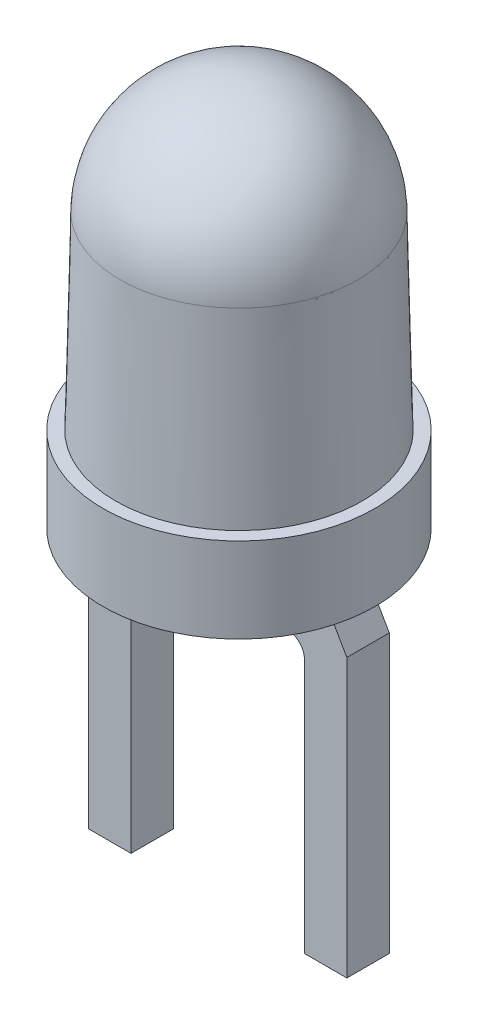
ISO-10303-21;
HEADER;
FILE_DESCRIPTION(('STEP AP214'),'2;1');
FILE_NAME('part.step','',(''),(''),'','','');
FILE_SCHEMA(('AUTOMOTIVE_DESIGN { 1 0 10303 214 1 1 1 1 }'));
ENDSEC;
DATA;
#1=APPLICATION_CONTEXT('core data for automotive mechanical design processes');
#2=APPLICATION_PROTOCOL_DEFINITION('international standard','automotive_design',2000,#1);
#3=PRODUCT_CONTEXT('',#1,'mechanical');
#4=PRODUCT('Part','Part','',(#3));
#5=PRODUCT_RELATED_PRODUCT_CATEGORY('part','',(#4));
#6=PRODUCT_DEFINITION_FORMATION('','',#4);
#7=PRODUCT_DEFINITION_CONTEXT('part definition',#1,'design');
#8=PRODUCT_DEFINITION('design','',#6,#7);
#9=PRODUCT_DEFINITION_SHAPE('','',#8);
#10=(LENGTH_UNIT() NAMED_UNIT(*) SI_UNIT(.MILLI.,.METRE.));
#11=(NAMED_UNIT(*) PLANE_ANGLE_UNIT() SI_UNIT($,.RADIAN.));
#12=(NAMED_UNIT(*) SI_UNIT($,.STERADIAN.) SOLID_ANGLE_UNIT());
#13=UNCERTAINTY_MEASURE_WITH_UNIT(LENGTH_MEASURE(1.E-05),#10,'distance_accuracy_value','');
#14=(GEOMETRIC_REPRESENTATION_CONTEXT(3) GLOBAL_UNCERTAINTY_ASSIGNED_CONTEXT((#13)) GLOBAL_UNIT_ASSIGNED_CONTEXT((#10,
#11,#12)) REPRESENTATION_CONTEXT('',''));
#15=CARTESIAN_POINT('',(0.,0.,0.));
#16=DIRECTION('',(0.,0.,1.));
#17=DIRECTION('',(1.,0.,0.));
#18=AXIS2_PLACEMENT_3D('',#15,#16,#17);
#19=CARTESIAN_POINT('',(0.,-36.0493117558647,0.25));
#20=DIRECTION('',(0.,0.,1.));
#21=DIRECTION('',(1.,0.,0.));
#22=AXIS2_PLACEMENT_3D('',#19,#20,#21);
#23=PLANE('',#22);
#24=DIRECTION('',(-0.500000000000017,-0.866025403784429,0.));
#25=VECTOR('',#24,1.);
#26=CARTESIAN_POINT('',(-1.27,0.,0.25));
#27=LINE('',#26,#25);
#28=CARTESIAN_POINT('',(-1.27,0.,0.25));
#29=VERTEX_POINT('',#28);
#30=CARTESIAN_POINT('',(-1.52,-0.433012701892208,0.25));
#31=VERTEX_POINT('',#30);
#32=EDGE_CURVE('E233',#29,#31,#27,.T.);
#33=ORIENTED_EDGE('',*,*,#32,.T.);
#34=DIRECTION('',(0.,1.,0.));
#35=VECTOR('',#34,1.);
#36=CARTESIAN_POINT('',(-1.52,-36.0493117558647,0.25));
#37=LINE('',#36,#35);
#38=CARTESIAN_POINT('',(-1.52,-3.7,0.25));
#39=VERTEX_POINT('',#38);
#40=EDGE_CURVE('E169',#31,#39,#37,.F.);
#41=ORIENTED_EDGE('',*,*,#40,.T.);
#42=DIRECTION('',(1.,0.,0.));
#43=VECTOR('',#42,1.);
#44=CARTESIAN_POINT('',(0.,-3.7,0.25));
#45=LINE('',#44,#43);
#46=CARTESIAN_POINT('',(-1.02,-3.7,0.25));
#47=VERTEX_POINT('',#46);
#48=EDGE_CURVE('E141',#39,#47,#45,.T.);
#49=ORIENTED_EDGE('',*,*,#48,.T.);
#50=DIRECTION('',(0.,-1.,0.));
#51=VECTOR('',#50,1.);
#52=CARTESIAN_POINT('',(-1.02,-36.0493117558647,0.25));
#53=LINE('',#52,#51);
#54=CARTESIAN_POINT('',(-1.02,-0.7,0.25));
#55=VERTEX_POINT('',#54);
#56=EDGE_CURVE('E138',#47,#55,#53,.F.);
#57=ORIENTED_EDGE('',*,*,#56,.T.);
#58=CARTESIAN_POINT('',(-0.820000000000004,-0.7,0.25));
#59=DIRECTION('',(0.,0.,1.));
#60=DIRECTION('',(1.,0.,0.));
#61=AXIS2_PLACEMENT_3D('',#58,#59,#60);
#62=CIRCLE('',#61,0.2);
#63=CARTESIAN_POINT('',(-0.820000000000004,-0.5,0.25));
#64=VERTEX_POINT('',#63);
#65=EDGE_CURVE('E19',#55,#64,#62,.F.);
#66=ORIENTED_EDGE('',*,*,#65,.T.);
#67=DIRECTION('',(1.,0.,0.));
#68=VECTOR('',#67,1.);
#69=CARTESIAN_POINT('',(0.,-0.5,0.25));
#70=LINE('',#69,#68);
#71=CARTESIAN_POINT('',(-0.420000000000004,-0.5,0.25));
#72=VERTEX_POINT('',#71);
#73=EDGE_CURVE('E178',#64,#72,#70,.T.);
#74=ORIENTED_EDGE('',*,*,#73,.T.);
#75=DIRECTION('',(0.,1.,0.));
#76=VECTOR('',#75,1.);
#77=CARTESIAN_POINT('',(-0.420000000000004,-36.0493117558647,0.25));
#78=LINE('',#77,#76);
#79=CARTESIAN_POINT('',(-0.420000000000003,0.,0.25));
#80=VERTEX_POINT('',#79);
#81=EDGE_CURVE('E239',#72,#80,#78,.T.);
#82=ORIENTED_EDGE('',*,*,#81,.T.);
#83=DIRECTION('',(1.,0.,0.));
#84=VECTOR('',#83,1.);
#85=CARTESIAN_POINT('',(0.,0.,0.25));
#86=LINE('',#85,#84);
#87=EDGE_CURVE('E236',#80,#29,#86,.F.);
#88=ORIENTED_EDGE('',*,*,#87,.T.);
#89=EDGE_LOOP('',(#33,#41,#49,#57,#66,#74,#82,#88));
#90=FACE_BOUND('',#89,.T.);
#91=ADVANCED_FACE('F16',(#90),#23,.T.);
#92=CARTESIAN_POINT('',(0.,-36.0493117558647,0.25));
#93=DIRECTION('',(0.,0.,1.));
#94=DIRECTION('',(1.,0.,0.));
#95=AXIS2_PLACEMENT_3D('',#92,#93,#94);
#96=PLANE('',#95);
#97=CARTESIAN_POINT('',(0.820000000000004,-0.699999999999999,0.25));
#98=DIRECTION('',(0.,0.,1.));
#99=DIRECTION('',(1.,0.,0.));
#100=AXIS2_PLACEMENT_3D('',#97,#98,#99);
#101=CIRCLE('',#100,0.2);
#102=CARTESIAN_POINT('',(0.820000000000004,-0.5,0.25));
#103=VERTEX_POINT('',#102);
#104=CARTESIAN_POINT('',(1.02,-0.699999999999999,0.25));
#105=VERTEX_POINT('',#104);
#106=EDGE_CURVE('E145',#103,#105,#101,.F.);
#107=ORIENTED_EDGE('',*,*,#106,.T.);
#108=DIRECTION('',(0.,-1.,0.));
#109=VECTOR('',#108,1.);
#110=CARTESIAN_POINT('',(1.02,-36.0493117558647,0.25));
#111=LINE('',#110,#109);
#112=CARTESIAN_POINT('',(1.02,-3.7,0.25));
#113=VERTEX_POINT('',#112);
#114=EDGE_CURVE('E205',#113,#105,#111,.F.);
#115=ORIENTED_EDGE('',*,*,#114,.F.);
#116=DIRECTION('',(1.,0.,0.));
#117=VECTOR('',#116,1.);
#118=CARTESIAN_POINT('',(0.,-3.7,0.25));
#119=LINE('',#118,#117);
#120=CARTESIAN_POINT('',(1.52,-3.7,0.25));
#121=VERTEX_POINT('',#120);
#122=EDGE_CURVE('E211',#113,#121,#119,.T.);
#123=ORIENTED_EDGE('',*,*,#122,.T.);
#124=DIRECTION('',(0.,1.,0.));
#125=VECTOR('',#124,1.);
#126=CARTESIAN_POINT('',(1.52,-36.0493117558647,0.25));
#127=LINE('',#126,#125);
#128=CARTESIAN_POINT('',(1.52,-0.433012701892209,0.25));
#129=VERTEX_POINT('',#128);
#130=EDGE_CURVE('E219',#129,#121,#127,.F.);
#131=ORIENTED_EDGE('',*,*,#130,.F.);
#132=DIRECTION('',(-0.500000000000005,0.866025403784436,0.));
#133=VECTOR('',#132,1.);
#134=CARTESIAN_POINT('',(1.52,-0.433012701892214,0.25));
#135=LINE('',#134,#133);
#136=CARTESIAN_POINT('',(1.27,0.,0.25));
#137=VERTEX_POINT('',#136);
#138=EDGE_CURVE('E235',#129,#137,#135,.T.);
#139=ORIENTED_EDGE('',*,*,#138,.T.);
#140=DIRECTION('',(1.,0.,0.));
#141=VECTOR('',#140,1.);
#142=CARTESIAN_POINT('',(0.,0.,0.25));
#143=LINE('',#142,#141);
#144=CARTESIAN_POINT('',(0.420000000000001,0.,0.25));
#145=VERTEX_POINT('',#144);
#146=EDGE_CURVE('E246',#137,#145,#143,.F.);
#147=ORIENTED_EDGE('',*,*,#146,.T.);
#148=DIRECTION('',(0.,1.,0.));
#149=VECTOR('',#148,1.);
#150=CARTESIAN_POINT('',(0.420000000000001,-36.0493117558647,0.25));
#151=LINE('',#150,#149);
#152=CARTESIAN_POINT('',(0.420000000000002,-0.5,0.25));
#153=VERTEX_POINT('',#152);
#154=EDGE_CURVE('E202',#145,#153,#151,.F.);
#155=ORIENTED_EDGE('',*,*,#154,.T.);
#156=DIRECTION('',(1.,0.,0.));
#157=VECTOR('',#156,1.);
#158=CARTESIAN_POINT('',(0.,-0.5,0.25));
#159=LINE('',#158,#157);
#160=EDGE_CURVE('E136',#153,#103,#159,.T.);
#161=ORIENTED_EDGE('',*,*,#160,.T.);
#162=EDGE_LOOP('',(#107,#115,#123,#131,#139,#147,#155,#161));
#163=FACE_BOUND('',#162,.T.);
#164=ADVANCED_FACE('F303',(#163),#96,.T.);
#165=CARTESIAN_POINT('',(-0.820000000000004,-0.7,0.25));
#166=DIRECTION('',(0.,0.,1.));
#167=DIRECTION('',(1.,0.,0.));
#168=AXIS2_PLACEMENT_3D('',#165,#166,#167);
#169=CYLINDRICAL_SURFACE('',#168,0.2);
#170=DIRECTION('',(0.,0.,1.));
#171=VECTOR('',#170,1.);
#172=CARTESIAN_POINT('',(-1.02,-0.699999999999999,0.25));
#173=LINE('',#172,#171);
#174=CARTESIAN_POINT('',(-1.02,-0.7,-0.25));
#175=VERTEX_POINT('',#174);
#176=EDGE_CURVE('E129',#55,#175,#173,.F.);
#177=ORIENTED_EDGE('',*,*,#176,.T.);
#178=CARTESIAN_POINT('',(-0.820000000000004,-0.7,-0.25));
#179=DIRECTION('',(0.,0.,1.));
#180=DIRECTION('',(1.,0.,0.));
#181=AXIS2_PLACEMENT_3D('',#178,#179,#180);
#182=CIRCLE('',#181,0.2);
#183=CARTESIAN_POINT('',(-0.820000000000004,-0.5,-0.25));
#184=VERTEX_POINT('',#183);
#185=EDGE_CURVE('E190',#175,#184,#182,.F.);
#186=ORIENTED_EDGE('',*,*,#185,.T.);
#187=DIRECTION('',(0.,0.,1.));
#188=VECTOR('',#187,1.);
#189=CARTESIAN_POINT('',(-0.820000000000004,-0.5,0.25));
#190=LINE('',#189,#188);
#191=EDGE_CURVE('E132',#184,#64,#190,.T.);
#192=ORIENTED_EDGE('',*,*,#191,.T.);
#193=ORIENTED_EDGE('',*,*,#65,.F.);
#194=EDGE_LOOP('',(#177,#186,#192,#193));
#195=FACE_BOUND('',#194,.T.);
#196=ADVANCED_FACE('F127',(#195),#169,.F.);
#197=CARTESIAN_POINT('',(0.,-0.5,0.25));
#198=DIRECTION('',(0.,1.,0.));
#199=DIRECTION('',(0.,0.,1.));
#200=AXIS2_PLACEMENT_3D('',#197,#198,#199);
#201=PLANE('',#200);
#202=ORIENTED_EDGE('',*,*,#191,.F.);
#203=DIRECTION('',(1.,0.,0.));
#204=VECTOR('',#203,1.);
#205=CARTESIAN_POINT('',(0.,-0.5,-0.25));
#206=LINE('',#205,#204);
#207=CARTESIAN_POINT('',(-0.420000000000004,-0.5,-0.25));
#208=VERTEX_POINT('',#207);
#209=EDGE_CURVE('E195',#184,#208,#206,.T.);
#210=ORIENTED_EDGE('',*,*,#209,.T.);
#211=DIRECTION('',(0.,0.,1.));
#212=VECTOR('',#211,1.);
#213=CARTESIAN_POINT('',(-0.420000000000004,-0.5,0.25));
#214=LINE('',#213,#212);
#215=EDGE_CURVE('E187',#208,#72,#214,.T.);
#216=ORIENTED_EDGE('',*,*,#215,.T.);
#217=ORIENTED_EDGE('',*,*,#73,.F.);
#218=EDGE_LOOP('',(#202,#210,#216,#217));
#219=FACE_BOUND('',#218,.T.);
#220=ADVANCED_FACE('F428',(#219),#201,.F.);
#221=CARTESIAN_POINT('',(-1.52,-36.0493117558647,0.25));
#222=DIRECTION('',(1.,0.,0.));
#223=DIRECTION('',(0.,1.,0.));
#224=AXIS2_PLACEMENT_3D('',#221,#222,#223);
#225=PLANE('',#224);
#226=DIRECTION('',(0.,0.,1.));
#227=VECTOR('',#226,1.);
#228=CARTESIAN_POINT('',(-1.52,-3.7,0.25));
#229=LINE('',#228,#227);
#230=CARTESIAN_POINT('',(-1.52,-3.7,-0.25));
#231=VERTEX_POINT('',#230);
#232=EDGE_CURVE('E154',#231,#39,#229,.T.);
#233=ORIENTED_EDGE('',*,*,#232,.T.);
#234=ORIENTED_EDGE('',*,*,#40,.F.);
#235=DIRECTION('',(0.,0.,1.));
#236=VECTOR('',#235,1.);
#237=CARTESIAN_POINT('',(-1.52,-0.433012701892208,0.25));
#238=LINE('',#237,#236);
#239=CARTESIAN_POINT('',(-1.52,-0.433012701892209,-0.25));
#240=VERTEX_POINT('',#239);
#241=EDGE_CURVE('E176',#240,#31,#238,.T.);
#242=ORIENTED_EDGE('',*,*,#241,.F.);
#243=DIRECTION('',(0.,1.,0.));
#244=VECTOR('',#243,1.);
#245=CARTESIAN_POINT('',(-1.52,-36.0493117558647,-0.25));
#246=LINE('',#245,#244);
#247=EDGE_CURVE('E164',#240,#231,#246,.F.);
#248=ORIENTED_EDGE('',*,*,#247,.T.);
#249=EDGE_LOOP('',(#233,#234,#242,#248));
#250=FACE_BOUND('',#249,.T.);
#251=ADVANCED_FACE('F424',(#250),#225,.F.);
#252=CARTESIAN_POINT('',(0.,-3.7,0.25));
#253=DIRECTION('',(0.,1.,0.));
#254=DIRECTION('',(0.,0.,1.));
#255=AXIS2_PLACEMENT_3D('',#252,#253,#254);
#256=PLANE('',#255);
#257=ORIENTED_EDGE('',*,*,#232,.F.);
#258=DIRECTION('',(1.,0.,0.));
#259=VECTOR('',#258,1.);
#260=CARTESIAN_POINT('',(0.,-3.7,-0.25));
#261=LINE('',#260,#259);
#262=CARTESIAN_POINT('',(-1.02,-3.7,-0.25));
#263=VERTEX_POINT('',#262);
#264=EDGE_CURVE('E162',#231,#263,#261,.T.);
#265=ORIENTED_EDGE('',*,*,#264,.T.);
#266=DIRECTION('',(0.,0.,1.));
#267=VECTOR('',#266,1.);
#268=CARTESIAN_POINT('',(-1.02,-3.7,0.25));
#269=LINE('',#268,#267);
#270=EDGE_CURVE('E146',#263,#47,#269,.T.);
#271=ORIENTED_EDGE('',*,*,#270,.T.);
#272=ORIENTED_EDGE('',*,*,#48,.F.);
#273=EDGE_LOOP('',(#257,#265,#271,#272));
#274=FACE_BOUND('',#273,.T.);
#275=ADVANCED_FACE('F421',(#274),#256,.F.);
#276=CARTESIAN_POINT('',(-1.02,-36.0493117558647,0.25));
#277=DIRECTION('',(-1.,0.,0.));
#278=DIRECTION('',(0.,-1.,0.));
#279=AXIS2_PLACEMENT_3D('',#276,#277,#278);
#280=PLANE('',#279);
#281=ORIENTED_EDGE('',*,*,#270,.F.);
#282=DIRECTION('',(0.,1.,0.));
#283=VECTOR('',#282,1.);
#284=CARTESIAN_POINT('',(-1.02,-36.0493117558647,-0.25));
#285=LINE('',#284,#283);
#286=EDGE_CURVE('E150',#263,#175,#285,.T.);
#287=ORIENTED_EDGE('',*,*,#286,.T.);
#288=ORIENTED_EDGE('',*,*,#176,.F.);
#289=ORIENTED_EDGE('',*,*,#56,.F.);
#290=EDGE_LOOP('',(#281,#287,#288,#289));
#291=FACE_BOUND('',#290,.T.);
#292=ADVANCED_FACE('F148',(#291),#280,.F.);
#293=CARTESIAN_POINT('',(0.820000000000004,-0.699999999999999,0.25));
#294=DIRECTION('',(0.,0.,1.));
#295=DIRECTION('',(1.,0.,0.));
#296=AXIS2_PLACEMENT_3D('',#293,#294,#295);
#297=CYLINDRICAL_SURFACE('',#296,0.2);
#298=DIRECTION('',(0.,0.,1.));
#299=VECTOR('',#298,1.);
#300=CARTESIAN_POINT('',(0.820000000000004,-0.5,0.25));
#301=LINE('',#300,#299);
#302=CARTESIAN_POINT('',(0.820000000000004,-0.5,-0.25));
#303=VERTEX_POINT('',#302);
#304=EDGE_CURVE('E191',#303,#103,#301,.T.);
#305=ORIENTED_EDGE('',*,*,#304,.F.);
#306=CARTESIAN_POINT('',(0.820000000000004,-0.699999999999999,-0.25));
#307=DIRECTION('',(0.,0.,1.));
#308=DIRECTION('',(1.,0.,0.));
#309=AXIS2_PLACEMENT_3D('',#306,#307,#308);
#310=CIRCLE('',#309,0.2);
#311=CARTESIAN_POINT('',(1.02,-0.699999999999999,-0.25));
#312=VERTEX_POINT('',#311);
#313=EDGE_CURVE('E296',#303,#312,#310,.F.);
#314=ORIENTED_EDGE('',*,*,#313,.T.);
#315=DIRECTION('',(0.,0.,1.));
#316=VECTOR('',#315,1.);
#317=CARTESIAN_POINT('',(1.02,-0.699999999999999,0.25));
#318=LINE('',#317,#316);
#319=EDGE_CURVE('E208',#105,#312,#318,.F.);
#320=ORIENTED_EDGE('',*,*,#319,.F.);
#321=ORIENTED_EDGE('',*,*,#106,.F.);
#322=EDGE_LOOP('',(#305,#314,#320,#321));
#323=FACE_BOUND('',#322,.T.);
#324=ADVANCED_FACE('F308',(#323),#297,.F.);
#325=CARTESIAN_POINT('',(1.02,-36.0493117558647,0.25));
#326=DIRECTION('',(-1.,0.,0.));
#327=DIRECTION('',(0.,-1.,0.));
#328=AXIS2_PLACEMENT_3D('',#325,#326,#327);
#329=PLANE('',#328);
#330=ORIENTED_EDGE('',*,*,#319,.T.);
#331=DIRECTION('',(0.,1.,0.));
#332=VECTOR('',#331,1.);
#333=CARTESIAN_POINT('',(1.02,-36.0493117558647,-0.25));
#334=LINE('',#333,#332);
#335=CARTESIAN_POINT('',(1.02,-3.7,-0.25));
#336=VERTEX_POINT('',#335);
#337=EDGE_CURVE('E298',#312,#336,#334,.F.);
#338=ORIENTED_EDGE('',*,*,#337,.T.);
#339=DIRECTION('',(0.,0.,1.));
#340=VECTOR('',#339,1.);
#341=CARTESIAN_POINT('',(1.02,-3.7,0.25));
#342=LINE('',#341,#340);
#343=EDGE_CURVE('E213',#336,#113,#342,.T.);
#344=ORIENTED_EDGE('',*,*,#343,.T.);
#345=ORIENTED_EDGE('',*,*,#114,.T.);
#346=EDGE_LOOP('',(#330,#338,#344,#345));
#347=FACE_BOUND('',#346,.T.);
#348=ADVANCED_FACE('F313',(#347),#329,.T.);
#349=CARTESIAN_POINT('',(0.,-3.7,0.25));
#350=DIRECTION('',(0.,1.,0.));
#351=DIRECTION('',(0.,0.,1.));
#352=AXIS2_PLACEMENT_3D('',#349,#350,#351);
#353=PLANE('',#352);
#354=DIRECTION('',(1.,0.,0.));
#355=VECTOR('',#354,1.);
#356=CARTESIAN_POINT('',(0.,-3.7,-0.25));
#357=LINE('',#356,#355);
#358=CARTESIAN_POINT('',(1.52,-3.7,-0.25));
#359=VERTEX_POINT('',#358);
#360=EDGE_CURVE('E349',#336,#359,#357,.T.);
#361=ORIENTED_EDGE('',*,*,#360,.T.);
#362=DIRECTION('',(0.,0.,1.));
#363=VECTOR('',#362,1.);
#364=CARTESIAN_POINT('',(1.52,-3.7,0.25));
#365=LINE('',#364,#363);
#366=EDGE_CURVE('E216',#121,#359,#365,.F.);
#367=ORIENTED_EDGE('',*,*,#366,.F.);
#368=ORIENTED_EDGE('',*,*,#122,.F.);
#369=ORIENTED_EDGE('',*,*,#343,.F.);
#370=EDGE_LOOP('',(#361,#367,#368,#369));
#371=FACE_BOUND('',#370,.T.);
#372=ADVANCED_FACE('F320',(#371),#353,.F.);
#373=CARTESIAN_POINT('',(1.52,-36.0493117558647,0.25));
#374=DIRECTION('',(1.,0.,0.));
#375=DIRECTION('',(0.,1.,0.));
#376=AXIS2_PLACEMENT_3D('',#373,#374,#375);
#377=PLANE('',#376);
#378=DIRECTION('',(0.,0.,1.));
#379=VECTOR('',#378,1.);
#380=CARTESIAN_POINT('',(1.51999999999999,-0.433012701892211,0.25));
#381=LINE('',#380,#379);
#382=CARTESIAN_POINT('',(1.52,-0.433012701892212,-0.25));
#383=VERTEX_POINT('',#382);
#384=EDGE_CURVE('E183',#129,#383,#381,.F.);
#385=ORIENTED_EDGE('',*,*,#384,.F.);
#386=ORIENTED_EDGE('',*,*,#130,.T.);
#387=ORIENTED_EDGE('',*,*,#366,.T.);
#388=DIRECTION('',(0.,1.,0.));
#389=VECTOR('',#388,1.);
#390=CARTESIAN_POINT('',(1.52,-36.0493117558647,-0.25));
#391=LINE('',#390,#389);
#392=EDGE_CURVE('E327',#359,#383,#391,.T.);
#393=ORIENTED_EDGE('',*,*,#392,.T.);
#394=EDGE_LOOP('',(#385,#386,#387,#393));
#395=FACE_BOUND('',#394,.T.);
#396=ADVANCED_FACE('F325',(#395),#377,.T.);
#397=CARTESIAN_POINT('',(0.,-0.5,0.25));
#398=DIRECTION('',(0.,-1.,0.));
#399=DIRECTION('',(1.,0.,0.));
#400=AXIS2_PLACEMENT_3D('',#397,#398,#399);
#401=PLANE('',#400);
#402=ORIENTED_EDGE('',*,*,#160,.F.);
#403=DIRECTION('',(0.,0.,1.));
#404=VECTOR('',#403,1.);
#405=CARTESIAN_POINT('',(0.420000000000004,-0.5,0.25));
#406=LINE('',#405,#404);
#407=CARTESIAN_POINT('',(0.420000000000001,-0.5,-0.25));
#408=VERTEX_POINT('',#407);
#409=EDGE_CURVE('E286',#408,#153,#406,.T.);
#410=ORIENTED_EDGE('',*,*,#409,.F.);
#411=DIRECTION('',(1.,0.,0.));
#412=VECTOR('',#411,1.);
#413=CARTESIAN_POINT('',(0.,-0.5,-0.25));
#414=LINE('',#413,#412);
#415=EDGE_CURVE('E299',#408,#303,#414,.T.);
#416=ORIENTED_EDGE('',*,*,#415,.T.);
#417=ORIENTED_EDGE('',*,*,#304,.T.);
#418=EDGE_LOOP('',(#402,#410,#416,#417));
#419=FACE_BOUND('',#418,.T.);
#420=ADVANCED_FACE('F407',(#419),#401,.T.);
#421=CARTESIAN_POINT('',(-0.420000000000232,-36.0493117558647,0.25));
#422=DIRECTION('',(-1.,0.,0.));
#423=DIRECTION('',(0.,-1.,0.));
#424=AXIS2_PLACEMENT_3D('',#421,#422,#423);
#425=PLANE('',#424);
#426=DIRECTION('',(0.,0.,-1.));
#427=VECTOR('',#426,1.);
#428=CARTESIAN_POINT('',(-0.420000000000001,0.,0.));
#429=LINE('',#428,#427);
#430=CARTESIAN_POINT('',(-0.420000000000002,0.,-0.25));
#431=VERTEX_POINT('',#430);
#432=EDGE_CURVE('E283',#80,#431,#429,.T.);
#433=ORIENTED_EDGE('',*,*,#432,.F.);
#434=ORIENTED_EDGE('',*,*,#81,.F.);
#435=ORIENTED_EDGE('',*,*,#215,.F.);
#436=DIRECTION('',(0.,1.,0.));
#437=VECTOR('',#436,1.);
#438=CARTESIAN_POINT('',(-0.420000000000004,-36.0493117558647,-0.25));
#439=LINE('',#438,#437);
#440=EDGE_CURVE('E173',#208,#431,#439,.T.);
#441=ORIENTED_EDGE('',*,*,#440,.T.);
#442=EDGE_LOOP('',(#433,#434,#435,#441));
#443=FACE_BOUND('',#442,.T.);
#444=ADVANCED_FACE('F403',(#443),#425,.F.);
#445=CARTESIAN_POINT('',(0.,-36.0493117558647,-0.25));
#446=DIRECTION('',(0.,0.,1.));
#447=DIRECTION('',(1.,0.,0.));
#448=AXIS2_PLACEMENT_3D('',#445,#446,#447);
#449=PLANE('',#448);
#450=ORIENTED_EDGE('',*,*,#264,.F.);
#451=ORIENTED_EDGE('',*,*,#247,.F.);
#452=DIRECTION('',(0.500000000000012,0.866025403784432,0.));
#453=VECTOR('',#452,1.);
#454=CARTESIAN_POINT('',(-16.5623098847622,-26.487057685495,-0.25));
#455=LINE('',#454,#453);
#456=CARTESIAN_POINT('',(-1.27,0.,-0.25));
#457=VERTEX_POINT('',#456);
#458=EDGE_CURVE('E181',#240,#457,#455,.T.);
#459=ORIENTED_EDGE('',*,*,#458,.T.);
#460=DIRECTION('',(1.,0.,0.));
#461=VECTOR('',#460,1.);
#462=CARTESIAN_POINT('',(0.,0.,-0.25));
#463=LINE('',#462,#461);
#464=EDGE_CURVE('E276',#431,#457,#463,.F.);
#465=ORIENTED_EDGE('',*,*,#464,.F.);
#466=ORIENTED_EDGE('',*,*,#440,.F.);
#467=ORIENTED_EDGE('',*,*,#209,.F.);
#468=ORIENTED_EDGE('',*,*,#185,.F.);
#469=ORIENTED_EDGE('',*,*,#286,.F.);
#470=EDGE_LOOP('',(#450,#451,#459,#465,#466,#467,#468,#469));
#471=FACE_BOUND('',#470,.T.);
#472=ADVANCED_FACE('F399',(#471),#449,.F.);
#473=CARTESIAN_POINT('',(-16.5623098847622,-26.487057685495,0.25));
#474=DIRECTION('',(0.866025403784432,-0.500000000000012,0.));
#475=DIRECTION('',(0.500000000000012,0.866025403784432,0.));
#476=AXIS2_PLACEMENT_3D('',#473,#474,#475);
#477=PLANE('',#476);
#478=ORIENTED_EDGE('',*,*,#241,.T.);
#479=ORIENTED_EDGE('',*,*,#32,.F.);
#480=DIRECTION('',(0.,0.,-1.));
#481=VECTOR('',#480,1.);
#482=CARTESIAN_POINT('',(-1.27,0.,0.));
#483=LINE('',#482,#481);
#484=EDGE_CURVE('E263',#457,#29,#483,.F.);
#485=ORIENTED_EDGE('',*,*,#484,.F.);
#486=ORIENTED_EDGE('',*,*,#458,.F.);
#487=EDGE_LOOP('',(#478,#479,#485,#486));
#488=FACE_BOUND('',#487,.T.);
#489=ADVANCED_FACE('F396',(#488),#477,.F.);
#490=CARTESIAN_POINT('',(16.562309884762,-26.4870576854953,0.25));
#491=DIRECTION('',(0.866025403784437,0.500000000000003,0.));
#492=DIRECTION('',(-0.500000000000003,0.866025403784437,0.));
#493=AXIS2_PLACEMENT_3D('',#490,#491,#492);
#494=PLANE('',#493);
#495=ORIENTED_EDGE('',*,*,#138,.F.);
#496=ORIENTED_EDGE('',*,*,#384,.T.);
#497=DIRECTION('',(-0.500000000000005,0.866025403784436,0.));
#498=VECTOR('',#497,1.);
#499=CARTESIAN_POINT('',(1.52,-0.433012701892214,-0.25));
#500=LINE('',#499,#498);
#501=CARTESIAN_POINT('',(1.27,0.,-0.25));
#502=VERTEX_POINT('',#501);
#503=EDGE_CURVE('E271',#383,#502,#500,.T.);
#504=ORIENTED_EDGE('',*,*,#503,.T.);
#505=DIRECTION('',(0.,0.,-1.));
#506=VECTOR('',#505,1.);
#507=CARTESIAN_POINT('',(1.27,0.,0.));
#508=LINE('',#507,#506);
#509=EDGE_CURVE('E260',#137,#502,#508,.T.);
#510=ORIENTED_EDGE('',*,*,#509,.F.);
#511=EDGE_LOOP('',(#495,#496,#504,#510));
#512=FACE_BOUND('',#511,.T.);
#513=ADVANCED_FACE('F330',(#512),#494,.T.);
#514=CARTESIAN_POINT('',(0.,-36.0493117558647,-0.25));
#515=DIRECTION('',(0.,0.,1.));
#516=DIRECTION('',(1.,0.,0.));
#517=AXIS2_PLACEMENT_3D('',#514,#515,#516);
#518=PLANE('',#517);
#519=ORIENTED_EDGE('',*,*,#360,.F.);
#520=ORIENTED_EDGE('',*,*,#337,.F.);
#521=ORIENTED_EDGE('',*,*,#313,.F.);
#522=ORIENTED_EDGE('',*,*,#415,.F.);
#523=DIRECTION('',(0.,-1.,0.));
#524=VECTOR('',#523,1.);
#525=CARTESIAN_POINT('',(0.420000000000223,-36.0493117558647,-0.25));
#526=LINE('',#525,#524);
#527=CARTESIAN_POINT('',(0.420000000000001,0.,-0.25));
#528=VERTEX_POINT('',#527);
#529=EDGE_CURVE('E34',#528,#408,#526,.T.);
#530=ORIENTED_EDGE('',*,*,#529,.F.);
#531=DIRECTION('',(1.,0.,0.));
#532=VECTOR('',#531,1.);
#533=CARTESIAN_POINT('',(0.,0.,-0.25));
#534=LINE('',#533,#532);
#535=EDGE_CURVE('E253',#502,#528,#534,.F.);
#536=ORIENTED_EDGE('',*,*,#535,.F.);
#537=ORIENTED_EDGE('',*,*,#503,.F.);
#538=ORIENTED_EDGE('',*,*,#392,.F.);
#539=EDGE_LOOP('',(#519,#520,#521,#522,#530,#536,#537,#538));
#540=FACE_BOUND('',#539,.T.);
#541=ADVANCED_FACE('F391',(#540),#518,.F.);
#542=CARTESIAN_POINT('',(0.420000000000223,-36.0493117558647,0.25));
#543=DIRECTION('',(-1.,0.,0.));
#544=DIRECTION('',(0.,-1.,0.));
#545=AXIS2_PLACEMENT_3D('',#542,#543,#544);
#546=PLANE('',#545);
#547=ORIENTED_EDGE('',*,*,#154,.F.);
#548=DIRECTION('',(0.,0.,-1.));
#549=VECTOR('',#548,1.);
#550=CARTESIAN_POINT('',(0.420000000000001,0.,0.));
#551=LINE('',#550,#549);
#552=EDGE_CURVE('E249',#528,#145,#551,.F.);
#553=ORIENTED_EDGE('',*,*,#552,.F.);
#554=ORIENTED_EDGE('',*,*,#529,.T.);
#555=ORIENTED_EDGE('',*,*,#409,.T.);
#556=EDGE_LOOP('',(#547,#553,#554,#555));
#557=FACE_BOUND('',#556,.T.);
#558=ADVANCED_FACE('F338',(#557),#546,.T.);
#559=CARTESIAN_POINT('',(0.,0.,0.));
#560=DIRECTION('',(0.,-1.,0.));
#561=DIRECTION('',(0.,0.,-1.));
#562=AXIS2_PLACEMENT_3D('',#559,#560,#561);
#563=PLANE('',#562);
#564=CARTESIAN_POINT('',(0.,0.,0.));
#565=DIRECTION('',(0.,-1.,0.));
#566=DIRECTION('',(0.,0.,-1.));
#567=AXIS2_PLACEMENT_3D('',#564,#565,#566);
#568=CIRCLE('',#567,1.6);
#569=CARTESIAN_POINT('',(0.,0.,-1.6));
#570=VERTEX_POINT('',#569);
#571=EDGE_CURVE('E252',#570,#570,#568,.F.);
#572=ORIENTED_EDGE('',*,*,#571,.F.);
#573=EDGE_LOOP('',(#572));
#574=FACE_BOUND('',#573,.T.);
#575=ORIENTED_EDGE('',*,*,#535,.T.);
#576=ORIENTED_EDGE('',*,*,#552,.T.);
#577=ORIENTED_EDGE('',*,*,#146,.F.);
#578=ORIENTED_EDGE('',*,*,#509,.T.);
#579=EDGE_LOOP('',(#575,#576,#577,#578));
#580=FACE_BOUND('',#579,.T.);
#581=ORIENTED_EDGE('',*,*,#464,.T.);
#582=ORIENTED_EDGE('',*,*,#484,.T.);
#583=ORIENTED_EDGE('',*,*,#87,.F.);
#584=ORIENTED_EDGE('',*,*,#432,.T.);
#585=EDGE_LOOP('',(#581,#582,#583,#584));
#586=FACE_BOUND('',#585,.T.);
#587=ADVANCED_FACE('F334',(#574,#580,#586),#563,.T.);
#588=CARTESIAN_POINT('',(0.,1.,0.));
#589=DIRECTION('',(0.,-1.,0.));
#590=DIRECTION('',(0.,0.,-1.));
#591=AXIS2_PLACEMENT_3D('',#588,#589,#590);
#592=CYLINDRICAL_SURFACE('',#591,1.6);
#593=ORIENTED_EDGE('',*,*,#571,.T.);
#594=EDGE_LOOP('',(#593));
#595=FACE_BOUND('',#594,.T.);
#596=CARTESIAN_POINT('',(0.,1.,0.));
#597=DIRECTION('',(0.,-1.,0.));
#598=DIRECTION('',(0.,0.,-1.));
#599=AXIS2_PLACEMENT_3D('',#596,#597,#598);
#600=CIRCLE('',#599,1.6);
#601=CARTESIAN_POINT('',(0.,1.,-1.6));
#602=VERTEX_POINT('',#601);
#603=EDGE_CURVE('E291',#602,#602,#600,.T.);
#604=ORIENTED_EDGE('',*,*,#603,.T.);
#605=EDGE_LOOP('',(#604));
#606=FACE_BOUND('',#605,.T.);
#607=ADVANCED_FACE('F381',(#595,#606),#592,.T.);
#608=CARTESIAN_POINT('',(0.,1.,0.));
#609=DIRECTION('',(0.,-1.,0.));
#610=DIRECTION('',(0.,0.,-1.));
#611=AXIS2_PLACEMENT_3D('',#608,#609,#610);
#612=PLANE('',#611);
#613=CARTESIAN_POINT('',(0.,0.999999999976353,0.));
#614=DIRECTION('',(0.,-1.,0.));
#615=DIRECTION('',(0.,0.,-1.));
#616=AXIS2_PLACEMENT_3D('',#613,#614,#615);
#617=CIRCLE('',#616,1.45000000000175);
#618=CARTESIAN_POINT('',(0.,0.999999999976353,-1.45000000000175));
#619=VERTEX_POINT('',#618);
#620=EDGE_CURVE('E11',#619,#619,#617,.F.);
#621=ORIENTED_EDGE('',*,*,#620,.F.);
#622=EDGE_LOOP('',(#621));
#623=FACE_BOUND('',#622,.T.);
#624=ORIENTED_EDGE('',*,*,#603,.F.);
#625=EDGE_LOOP('',(#624));
#626=FACE_BOUND('',#625,.T.);
#627=ADVANCED_FACE('F377',(#623,#626),#612,.F.);
#628=CARTESIAN_POINT('',(0.,3.2,0.));
#629=DIRECTION('',(-1.,0.,0.));
#630=DIRECTION('',(0.,1.,0.));
#631=AXIS2_PLACEMENT_3D('',#628,#629,#630);
#632=SPHERICAL_SURFACE('',#631,1.4);
#633=CARTESIAN_POINT('',(0.,3.2315833489065,0.));
#634=DIRECTION('',(0.,-1.,0.));
#635=DIRECTION('',(0.,0.,-1.));
#636=AXIS2_PLACEMENT_3D('',#633,#634,#635);
#637=CIRCLE('',#636,1.39964370183046);
#638=CARTESIAN_POINT('',(0.,3.2315833489065,-1.39964370183046));
#639=VERTEX_POINT('',#638);
#640=EDGE_CURVE('E25',#639,#639,#637,.T.);
#641=ORIENTED_EDGE('',*,*,#640,.F.);
#642=EDGE_LOOP('',(#641));
#643=FACE_BOUND('',#642,.T.);
#644=ADVANCED_FACE('F372',(#643),#632,.T.);
#645=CARTESIAN_POINT('',(0.,1.00000000020373,0.));
#646=DIRECTION('',(0.,-1.,0.));
#647=DIRECTION('',(0.,0.,-1.));
#648=AXIS2_PLACEMENT_3D('',#645,#646,#647);
#649=CONICAL_SURFACE('',#648,1.44999999999662,0.0225614489378871);
#650=ORIENTED_EDGE('',*,*,#620,.T.);
#651=EDGE_LOOP('',(#650));
#652=FACE_BOUND('',#651,.T.);
#653=ORIENTED_EDGE('',*,*,#640,.T.);
#654=EDGE_LOOP('',(#653));
#655=FACE_BOUND('',#654,.T.);
#656=ADVANCED_FACE('F376',(#652,#655),#649,.T.);
#657=CLOSED_SHELL('',(#91,#164,#196,#220,#251,#275,#292,#324,#348,#372,#396,#420,#444,#472,#489,
#513,#541,#558,#587,#607,#627,#644,#656));
#658=MANIFOLD_SOLID_BREP('B1',#657);
#659=ADVANCED_BREP_SHAPE_REPRESENTATION('',(#18,#658),#14);
#660=SHAPE_DEFINITION_REPRESENTATION(#9,#659);
ENDSEC;
END-ISO-10303-21;
